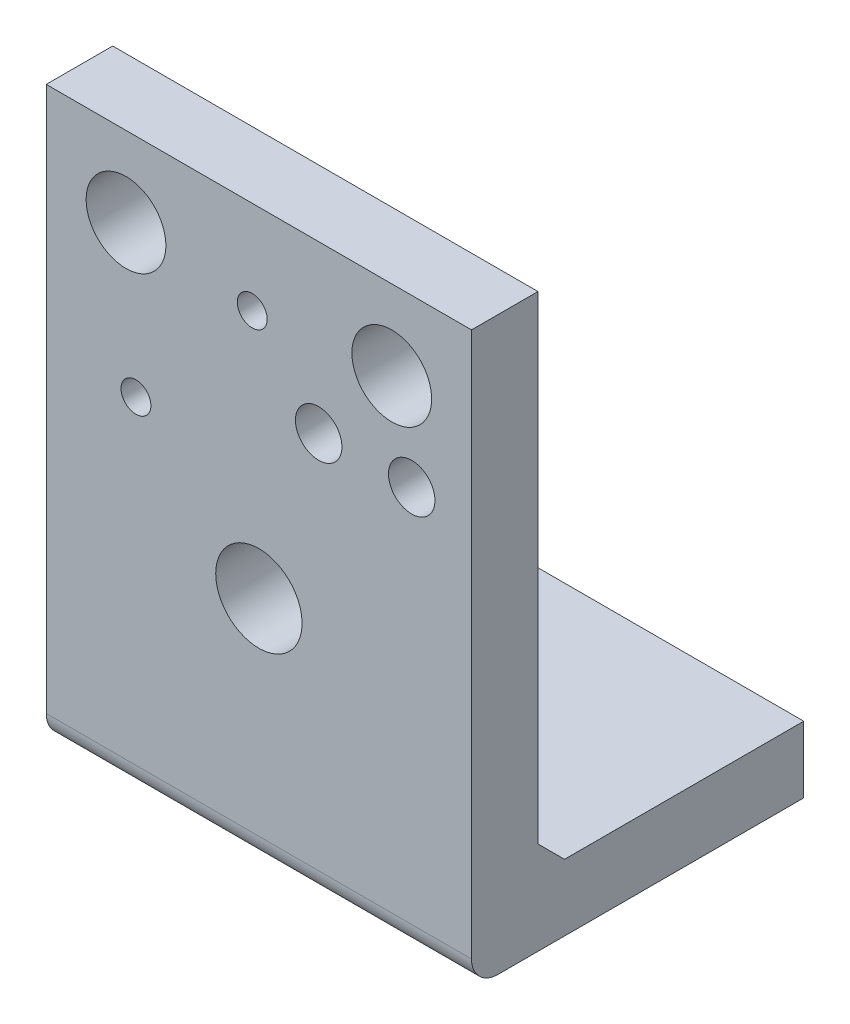
ISO-10303-21;
HEADER;
FILE_DESCRIPTION(('STEP AP214'),'2;1');
FILE_NAME('part.step','',(''),(''),'','','');
FILE_SCHEMA(('AUTOMOTIVE_DESIGN { 1 0 10303 214 1 1 1 1 }'));
ENDSEC;
DATA;
#1=APPLICATION_CONTEXT('core data for automotive mechanical design processes');
#2=APPLICATION_PROTOCOL_DEFINITION('international standard','automotive_design',2000,#1);
#3=PRODUCT_CONTEXT('',#1,'mechanical');
#4=PRODUCT('Part','Part','',(#3));
#5=PRODUCT_RELATED_PRODUCT_CATEGORY('part','',(#4));
#6=PRODUCT_DEFINITION_FORMATION('','',#4);
#7=PRODUCT_DEFINITION_CONTEXT('part definition',#1,'design');
#8=PRODUCT_DEFINITION('design','',#6,#7);
#9=PRODUCT_DEFINITION_SHAPE('','',#8);
#10=(LENGTH_UNIT() NAMED_UNIT(*) SI_UNIT(.MILLI.,.METRE.));
#11=(NAMED_UNIT(*) PLANE_ANGLE_UNIT() SI_UNIT($,.RADIAN.));
#12=(NAMED_UNIT(*) SI_UNIT($,.STERADIAN.) SOLID_ANGLE_UNIT());
#13=UNCERTAINTY_MEASURE_WITH_UNIT(LENGTH_MEASURE(1.E-05),#10,'distance_accuracy_value','');
#14=(GEOMETRIC_REPRESENTATION_CONTEXT(3) GLOBAL_UNCERTAINTY_ASSIGNED_CONTEXT((#13)) GLOBAL_UNIT_ASSIGNED_CONTEXT((#10,
#11,#12)) REPRESENTATION_CONTEXT('',''));
#15=CARTESIAN_POINT('',(0.,0.,0.));
#16=DIRECTION('',(0.,0.,1.));
#17=DIRECTION('',(1.,0.,0.));
#18=AXIS2_PLACEMENT_3D('',#15,#16,#17);
#19=CARTESIAN_POINT('',(0.,0.,0.));
#20=DIRECTION('',(0.,0.,1.));
#21=DIRECTION('',(1.,0.,0.));
#22=AXIS2_PLACEMENT_3D('',#19,#20,#21);
#23=PLANE('',#22);
#24=CARTESIAN_POINT('',(0.,-8.,0.));
#25=DIRECTION('',(0.,0.,-1.));
#26=DIRECTION('',(-1.,0.,0.));
#27=AXIS2_PLACEMENT_3D('',#24,#25,#26);
#28=CIRCLE('',#27,6.5);
#29=CARTESIAN_POINT('',(-6.50000000000001,-8.,0.));
#30=VERTEX_POINT('',#29);
#31=EDGE_CURVE('E509',#30,#30,#28,.T.);
#32=ORIENTED_EDGE('',*,*,#31,.F.);
#33=EDGE_LOOP('',(#32));
#34=FACE_BOUND('',#33,.T.);
#35=CARTESIAN_POINT('',(-18.5,8.99999999999999,0.));
#36=DIRECTION('',(0.,0.,-1.));
#37=DIRECTION('',(-1.,0.,0.));
#38=AXIS2_PLACEMENT_3D('',#35,#36,#37);
#39=CIRCLE('',#38,2.25);
#40=CARTESIAN_POINT('',(-20.75,8.99999999999999,0.));
#41=VERTEX_POINT('',#40);
#42=EDGE_CURVE('E549',#41,#41,#39,.T.);
#43=ORIENTED_EDGE('',*,*,#42,.F.);
#44=EDGE_LOOP('',(#43));
#45=FACE_BOUND('',#44,.T.);
#46=CARTESIAN_POINT('',(23.,18.,0.));
#47=DIRECTION('',(0.,0.,-1.));
#48=DIRECTION('',(-1.,0.,0.));
#49=AXIS2_PLACEMENT_3D('',#46,#47,#48);
#50=CIRCLE('',#49,3.5);
#51=CARTESIAN_POINT('',(19.5,18.,0.));
#52=VERTEX_POINT('',#51);
#53=EDGE_CURVE('E541',#52,#52,#50,.T.);
#54=ORIENTED_EDGE('',*,*,#53,.F.);
#55=EDGE_LOOP('',(#54));
#56=FACE_BOUND('',#55,.T.);
#57=CARTESIAN_POINT('',(8.99999999999999,18.,0.));
#58=DIRECTION('',(0.,0.,-1.));
#59=DIRECTION('',(-1.,0.,0.));
#60=AXIS2_PLACEMENT_3D('',#57,#58,#59);
#61=CIRCLE('',#60,3.5);
#62=CARTESIAN_POINT('',(5.49999999999999,18.,0.));
#63=VERTEX_POINT('',#62);
#64=EDGE_CURVE('E533',#63,#63,#61,.T.);
#65=ORIENTED_EDGE('',*,*,#64,.F.);
#66=EDGE_LOOP('',(#65));
#67=FACE_BOUND('',#66,.T.);
#68=CARTESIAN_POINT('',(20.,31.,0.));
#69=DIRECTION('',(0.,0.,-1.));
#70=DIRECTION('',(-1.,0.,0.));
#71=AXIS2_PLACEMENT_3D('',#68,#69,#70);
#72=CIRCLE('',#71,6.);
#73=CARTESIAN_POINT('',(14.,31.,0.));
#74=VERTEX_POINT('',#73);
#75=EDGE_CURVE('E525',#74,#74,#72,.T.);
#76=ORIENTED_EDGE('',*,*,#75,.F.);
#77=EDGE_LOOP('',(#76));
#78=FACE_BOUND('',#77,.T.);
#79=CARTESIAN_POINT('',(-1.00000000000001,29.,0.));
#80=DIRECTION('',(0.,0.,-1.));
#81=DIRECTION('',(-1.,0.,0.));
#82=AXIS2_PLACEMENT_3D('',#79,#80,#81);
#83=CIRCLE('',#82,2.25);
#84=CARTESIAN_POINT('',(-3.25000000000001,29.,0.));
#85=VERTEX_POINT('',#84);
#86=EDGE_CURVE('E517',#85,#85,#83,.T.);
#87=ORIENTED_EDGE('',*,*,#86,.F.);
#88=EDGE_LOOP('',(#87));
#89=FACE_BOUND('',#88,.T.);
#90=CARTESIAN_POINT('',(-20.,31.,0.));
#91=DIRECTION('',(0.,0.,-1.));
#92=DIRECTION('',(-1.,0.,0.));
#93=AXIS2_PLACEMENT_3D('',#90,#91,#92);
#94=CIRCLE('',#93,6.);
#95=CARTESIAN_POINT('',(-26.,31.,0.));
#96=VERTEX_POINT('',#95);
#97=EDGE_CURVE('E130',#96,#96,#94,.T.);
#98=ORIENTED_EDGE('',*,*,#97,.F.);
#99=EDGE_LOOP('',(#98));
#100=FACE_BOUND('',#99,.T.);
#101=DIRECTION('',(0.,1.,0.));
#102=VECTOR('',#101,1.);
#103=CARTESIAN_POINT('',(32.,43.,0.));
#104=LINE('',#103,#102);
#105=CARTESIAN_POINT('',(32.,-29.,0.));
#106=VERTEX_POINT('',#105);
#107=CARTESIAN_POINT('',(32.,43.,0.));
#108=VERTEX_POINT('',#107);
#109=EDGE_CURVE('E145',#106,#108,#104,.T.);
#110=ORIENTED_EDGE('',*,*,#109,.F.);
#111=DIRECTION('',(-1.,0.,0.));
#112=VECTOR('',#111,1.);
#113=CARTESIAN_POINT('',(-32.,-29.,0.));
#114=LINE('',#113,#112);
#115=CARTESIAN_POINT('',(-32.,-29.,0.));
#116=VERTEX_POINT('',#115);
#117=EDGE_CURVE('E178',#106,#116,#114,.T.);
#118=ORIENTED_EDGE('',*,*,#117,.T.);
#119=DIRECTION('',(0.,-1.,0.));
#120=VECTOR('',#119,1.);
#121=CARTESIAN_POINT('',(-32.,43.,0.));
#122=LINE('',#121,#120);
#123=CARTESIAN_POINT('',(-32.,43.,0.));
#124=VERTEX_POINT('',#123);
#125=EDGE_CURVE('E150',#124,#116,#122,.T.);
#126=ORIENTED_EDGE('',*,*,#125,.F.);
#127=DIRECTION('',(-1.,0.,0.));
#128=VECTOR('',#127,1.);
#129=CARTESIAN_POINT('',(-32.,43.,0.));
#130=LINE('',#129,#128);
#131=EDGE_CURVE('E158',#108,#124,#130,.T.);
#132=ORIENTED_EDGE('',*,*,#131,.F.);
#133=EDGE_LOOP('',(#110,#118,#126,#132));
#134=FACE_BOUND('',#133,.T.);
#135=ADVANCED_FACE('F41',(#34,#45,#56,#67,#78,#89,#100,#134),#23,.F.);
#136=CARTESIAN_POINT('',(32.,43.,10.));
#137=DIRECTION('',(-1.,0.,0.));
#138=DIRECTION('',(0.,-1.,0.));
#139=AXIS2_PLACEMENT_3D('',#136,#137,#138);
#140=PLANE('',#139);
#141=DIRECTION('',(0.,1.,0.));
#142=VECTOR('',#141,1.);
#143=CARTESIAN_POINT('',(32.,43.,10.));
#144=LINE('',#143,#142);
#145=CARTESIAN_POINT('',(32.,-39.,10.));
#146=VERTEX_POINT('',#145);
#147=CARTESIAN_POINT('',(32.,43.,10.));
#148=VERTEX_POINT('',#147);
#149=EDGE_CURVE('E146',#146,#148,#144,.T.);
#150=ORIENTED_EDGE('',*,*,#149,.F.);
#151=CARTESIAN_POINT('',(32.,-39.,6.));
#152=DIRECTION('',(-1.,0.,0.));
#153=DIRECTION('',(0.,-1.,0.));
#154=AXIS2_PLACEMENT_3D('',#151,#152,#153);
#155=CIRCLE('',#154,4.);
#156=CARTESIAN_POINT('',(32.,-43.,6.));
#157=VERTEX_POINT('',#156);
#158=EDGE_CURVE('E64',#146,#157,#155,.F.);
#159=ORIENTED_EDGE('',*,*,#158,.T.);
#160=DIRECTION('',(0.,0.,-1.));
#161=VECTOR('',#160,1.);
#162=CARTESIAN_POINT('',(32.,-43.,10.));
#163=LINE('',#162,#161);
#164=CARTESIAN_POINT('',(32.,-43.,-40.));
#165=VERTEX_POINT('',#164);
#166=EDGE_CURVE('E103',#157,#165,#163,.T.);
#167=ORIENTED_EDGE('',*,*,#166,.T.);
#168=DIRECTION('',(0.,-1.,0.));
#169=VECTOR('',#168,1.);
#170=CARTESIAN_POINT('',(32.,-43.,-40.));
#171=LINE('',#170,#169);
#172=CARTESIAN_POINT('',(32.,-33.,-40.));
#173=VERTEX_POINT('',#172);
#174=EDGE_CURVE('E108',#173,#165,#171,.T.);
#175=ORIENTED_EDGE('',*,*,#174,.F.);
#176=DIRECTION('',(0.,0.,1.));
#177=VECTOR('',#176,1.);
#178=CARTESIAN_POINT('',(32.,-33.,-40.));
#179=LINE('',#178,#177);
#180=CARTESIAN_POINT('',(32.,-33.,-4.00000000000003));
#181=VERTEX_POINT('',#180);
#182=EDGE_CURVE('E138',#173,#181,#179,.T.);
#183=ORIENTED_EDGE('',*,*,#182,.T.);
#184=DIRECTION('',(0.,-0.707106781186544,-0.707106781186551));
#185=VECTOR('',#184,1.);
#186=CARTESIAN_POINT('',(32.,11.9999999999996,41.));
#187=LINE('',#186,#185);
#188=EDGE_CURVE('E181',#181,#106,#187,.F.);
#189=ORIENTED_EDGE('',*,*,#188,.T.);
#190=ORIENTED_EDGE('',*,*,#109,.T.);
#191=DIRECTION('',(0.,0.,-1.));
#192=VECTOR('',#191,1.);
#193=CARTESIAN_POINT('',(32.,43.,10.));
#194=LINE('',#193,#192);
#195=EDGE_CURVE('E170',#148,#108,#194,.T.);
#196=ORIENTED_EDGE('',*,*,#195,.F.);
#197=EDGE_LOOP('',(#150,#159,#167,#175,#183,#189,#190,#196));
#198=FACE_BOUND('',#197,.T.);
#199=ADVANCED_FACE('F105',(#198),#140,.F.);
#200=CARTESIAN_POINT('',(-32.,43.,10.));
#201=DIRECTION('',(0.,-1.,0.));
#202=DIRECTION('',(0.,0.,-1.));
#203=AXIS2_PLACEMENT_3D('',#200,#201,#202);
#204=PLANE('',#203);
#205=ORIENTED_EDGE('',*,*,#131,.T.);
#206=DIRECTION('',(0.,0.,-1.));
#207=VECTOR('',#206,1.);
#208=CARTESIAN_POINT('',(-32.,43.,10.));
#209=LINE('',#208,#207);
#210=CARTESIAN_POINT('',(-32.,43.,10.));
#211=VERTEX_POINT('',#210);
#212=EDGE_CURVE('E166',#211,#124,#209,.T.);
#213=ORIENTED_EDGE('',*,*,#212,.F.);
#214=DIRECTION('',(-1.,0.,0.));
#215=VECTOR('',#214,1.);
#216=CARTESIAN_POINT('',(-32.,43.,10.));
#217=LINE('',#216,#215);
#218=EDGE_CURVE('E149',#148,#211,#217,.T.);
#219=ORIENTED_EDGE('',*,*,#218,.F.);
#220=ORIENTED_EDGE('',*,*,#195,.T.);
#221=EDGE_LOOP('',(#205,#213,#219,#220));
#222=FACE_BOUND('',#221,.T.);
#223=ADVANCED_FACE('F204',(#222),#204,.F.);
#224=CARTESIAN_POINT('',(-32.,43.,10.));
#225=DIRECTION('',(1.,0.,0.));
#226=DIRECTION('',(0.,1.,0.));
#227=AXIS2_PLACEMENT_3D('',#224,#225,#226);
#228=PLANE('',#227);
#229=DIRECTION('',(0.,0.,-1.));
#230=VECTOR('',#229,1.);
#231=CARTESIAN_POINT('',(-32.,-43.,10.));
#232=LINE('',#231,#230);
#233=CARTESIAN_POINT('',(-32.,-43.,6.));
#234=VERTEX_POINT('',#233);
#235=CARTESIAN_POINT('',(-32.,-43.,-40.));
#236=VERTEX_POINT('',#235);
#237=EDGE_CURVE('E110',#234,#236,#232,.T.);
#238=ORIENTED_EDGE('',*,*,#237,.F.);
#239=CARTESIAN_POINT('',(-32.,-39.,6.));
#240=DIRECTION('',(1.,0.,0.));
#241=DIRECTION('',(0.,1.,0.));
#242=AXIS2_PLACEMENT_3D('',#239,#240,#241);
#243=CIRCLE('',#242,4.);
#244=CARTESIAN_POINT('',(-32.,-39.,10.));
#245=VERTEX_POINT('',#244);
#246=EDGE_CURVE('E11',#234,#245,#243,.F.);
#247=ORIENTED_EDGE('',*,*,#246,.T.);
#248=DIRECTION('',(0.,-1.,0.));
#249=VECTOR('',#248,1.);
#250=CARTESIAN_POINT('',(-32.,43.,10.));
#251=LINE('',#250,#249);
#252=EDGE_CURVE('E111',#211,#245,#251,.T.);
#253=ORIENTED_EDGE('',*,*,#252,.F.);
#254=ORIENTED_EDGE('',*,*,#212,.T.);
#255=ORIENTED_EDGE('',*,*,#125,.T.);
#256=DIRECTION('',(0.,0.707106781186544,0.707106781186551));
#257=VECTOR('',#256,1.);
#258=CARTESIAN_POINT('',(-32.,11.9999999999996,41.));
#259=LINE('',#258,#257);
#260=CARTESIAN_POINT('',(-32.,-33.,-4.00000000000003));
#261=VERTEX_POINT('',#260);
#262=EDGE_CURVE('E184',#116,#261,#259,.F.);
#263=ORIENTED_EDGE('',*,*,#262,.T.);
#264=DIRECTION('',(0.,0.,1.));
#265=VECTOR('',#264,1.);
#266=CARTESIAN_POINT('',(-32.,-33.,-40.));
#267=LINE('',#266,#265);
#268=CARTESIAN_POINT('',(-32.,-33.,-40.));
#269=VERTEX_POINT('',#268);
#270=EDGE_CURVE('E141',#269,#261,#267,.T.);
#271=ORIENTED_EDGE('',*,*,#270,.F.);
#272=DIRECTION('',(0.,1.,0.));
#273=VECTOR('',#272,1.);
#274=CARTESIAN_POINT('',(-32.,-43.,-40.));
#275=LINE('',#274,#273);
#276=EDGE_CURVE('E119',#236,#269,#275,.T.);
#277=ORIENTED_EDGE('',*,*,#276,.F.);
#278=EDGE_LOOP('',(#238,#247,#253,#254,#255,#263,#271,#277));
#279=FACE_BOUND('',#278,.T.);
#280=ADVANCED_FACE('F208',(#279),#228,.F.);
#281=CARTESIAN_POINT('',(-32.,-43.,10.));
#282=DIRECTION('',(0.,1.,0.));
#283=DIRECTION('',(0.,0.,1.));
#284=AXIS2_PLACEMENT_3D('',#281,#282,#283);
#285=PLANE('',#284);
#286=CARTESIAN_POINT('',(-5.25,-43.,-11.25));
#287=DIRECTION('',(0.,1.,0.));
#288=DIRECTION('',(0.,0.,1.));
#289=AXIS2_PLACEMENT_3D('',#286,#287,#288);
#290=CIRCLE('',#289,1.25);
#291=CARTESIAN_POINT('',(-5.25,-43.,-10.));
#292=VERTEX_POINT('',#291);
#293=EDGE_CURVE('E471',#292,#292,#290,.T.);
#294=ORIENTED_EDGE('',*,*,#293,.T.);
#295=EDGE_LOOP('',(#294));
#296=FACE_BOUND('',#295,.T.);
#297=CARTESIAN_POINT('',(5.25,-43.,-11.25));
#298=DIRECTION('',(0.,1.,0.));
#299=DIRECTION('',(0.,0.,1.));
#300=AXIS2_PLACEMENT_3D('',#297,#298,#299);
#301=CIRCLE('',#300,1.25);
#302=CARTESIAN_POINT('',(5.25,-43.,-10.));
#303=VERTEX_POINT('',#302);
#304=EDGE_CURVE('E504',#303,#303,#301,.T.);
#305=ORIENTED_EDGE('',*,*,#304,.T.);
#306=EDGE_LOOP('',(#305));
#307=FACE_BOUND('',#306,.T.);
#308=CARTESIAN_POINT('',(0.,-43.,-6.95405845398161));
#309=DIRECTION('',(0.,1.,0.));
#310=DIRECTION('',(0.,0.,1.));
#311=AXIS2_PLACEMENT_3D('',#308,#309,#310);
#312=CIRCLE('',#311,2.);
#313=CARTESIAN_POINT('',(0.,-43.,-4.95405845398161));
#314=VERTEX_POINT('',#313);
#315=EDGE_CURVE('E496',#314,#314,#312,.T.);
#316=ORIENTED_EDGE('',*,*,#315,.T.);
#317=EDGE_LOOP('',(#316));
#318=FACE_BOUND('',#317,.T.);
#319=CARTESIAN_POINT('',(5.25,-43.,-21.75));
#320=DIRECTION('',(0.,1.,0.));
#321=DIRECTION('',(0.,0.,1.));
#322=AXIS2_PLACEMENT_3D('',#319,#320,#321);
#323=CIRCLE('',#322,1.25);
#324=CARTESIAN_POINT('',(5.25,-43.,-20.5));
#325=VERTEX_POINT('',#324);
#326=EDGE_CURVE('E487',#325,#325,#323,.T.);
#327=ORIENTED_EDGE('',*,*,#326,.T.);
#328=EDGE_LOOP('',(#327));
#329=FACE_BOUND('',#328,.T.);
#330=CARTESIAN_POINT('',(-9.54594154601839,-43.,-16.5));
#331=DIRECTION('',(0.,1.,0.));
#332=DIRECTION('',(0.,0.,1.));
#333=AXIS2_PLACEMENT_3D('',#330,#331,#332);
#334=CIRCLE('',#333,2.);
#335=CARTESIAN_POINT('',(-9.54594154601839,-43.,-14.5));
#336=VERTEX_POINT('',#335);
#337=EDGE_CURVE('E584',#336,#336,#334,.T.);
#338=ORIENTED_EDGE('',*,*,#337,.T.);
#339=EDGE_LOOP('',(#338));
#340=FACE_BOUND('',#339,.T.);
#341=CARTESIAN_POINT('',(0.,-43.,-26.0459415460184));
#342=DIRECTION('',(0.,1.,0.));
#343=DIRECTION('',(0.,0.,1.));
#344=AXIS2_PLACEMENT_3D('',#341,#342,#343);
#345=CIRCLE('',#344,2.);
#346=CARTESIAN_POINT('',(0.,-43.,-24.0459415460184));
#347=VERTEX_POINT('',#346);
#348=EDGE_CURVE('E573',#347,#347,#345,.T.);
#349=ORIENTED_EDGE('',*,*,#348,.T.);
#350=EDGE_LOOP('',(#349));
#351=FACE_BOUND('',#350,.T.);
#352=CARTESIAN_POINT('',(9.54594154601839,-43.,-16.5));
#353=DIRECTION('',(0.,1.,0.));
#354=DIRECTION('',(0.,0.,1.));
#355=AXIS2_PLACEMENT_3D('',#352,#353,#354);
#356=CIRCLE('',#355,2.);
#357=CARTESIAN_POINT('',(9.54594154601839,-43.,-14.5));
#358=VERTEX_POINT('',#357);
#359=EDGE_CURVE('E572',#358,#358,#356,.T.);
#360=ORIENTED_EDGE('',*,*,#359,.T.);
#361=EDGE_LOOP('',(#360));
#362=FACE_BOUND('',#361,.T.);
#363=CARTESIAN_POINT('',(-5.25,-43.,-21.75));
#364=DIRECTION('',(0.,1.,0.));
#365=DIRECTION('',(0.,0.,1.));
#366=AXIS2_PLACEMENT_3D('',#363,#364,#365);
#367=CIRCLE('',#366,1.25);
#368=CARTESIAN_POINT('',(-5.25,-43.,-20.5));
#369=VERTEX_POINT('',#368);
#370=EDGE_CURVE('E476',#369,#369,#367,.T.);
#371=ORIENTED_EDGE('',*,*,#370,.T.);
#372=EDGE_LOOP('',(#371));
#373=FACE_BOUND('',#372,.T.);
#374=CARTESIAN_POINT('',(0.,-43.,-16.5));
#375=DIRECTION('',(0.,1.,0.));
#376=DIRECTION('',(0.,0.,1.));
#377=AXIS2_PLACEMENT_3D('',#374,#375,#376);
#378=CIRCLE('',#377,2.);
#379=CARTESIAN_POINT('',(0.,-43.,-14.5));
#380=VERTEX_POINT('',#379);
#381=EDGE_CURVE('E505',#380,#380,#378,.T.);
#382=ORIENTED_EDGE('',*,*,#381,.T.);
#383=EDGE_LOOP('',(#382));
#384=FACE_BOUND('',#383,.T.);
#385=ORIENTED_EDGE('',*,*,#166,.F.);
#386=DIRECTION('',(1.,0.,0.));
#387=VECTOR('',#386,1.);
#388=CARTESIAN_POINT('',(-32.,-43.,6.));
#389=LINE('',#388,#387);
#390=EDGE_CURVE('E50',#157,#234,#389,.F.);
#391=ORIENTED_EDGE('',*,*,#390,.T.);
#392=ORIENTED_EDGE('',*,*,#237,.T.);
#393=DIRECTION('',(-1.,0.,0.));
#394=VECTOR('',#393,1.);
#395=CARTESIAN_POINT('',(32.,-43.,-40.));
#396=LINE('',#395,#394);
#397=EDGE_CURVE('E114',#165,#236,#396,.T.);
#398=ORIENTED_EDGE('',*,*,#397,.F.);
#399=EDGE_LOOP('',(#385,#391,#392,#398));
#400=FACE_BOUND('',#399,.T.);
#401=ADVANCED_FACE('F115',(#296,#307,#318,#329,#340,#351,#362,#373,#384,#400),#285,.F.);
#402=CARTESIAN_POINT('',(0.,0.,10.));
#403=DIRECTION('',(0.,0.,1.));
#404=DIRECTION('',(1.,0.,0.));
#405=AXIS2_PLACEMENT_3D('',#402,#403,#404);
#406=PLANE('',#405);
#407=CARTESIAN_POINT('',(0.,-8.,10.));
#408=DIRECTION('',(0.,0.,-1.));
#409=DIRECTION('',(-1.,0.,0.));
#410=AXIS2_PLACEMENT_3D('',#407,#408,#409);
#411=CIRCLE('',#410,6.5);
#412=CARTESIAN_POINT('',(-6.50000000000001,-8.,10.));
#413=VERTEX_POINT('',#412);
#414=EDGE_CURVE('E553',#413,#413,#411,.T.);
#415=ORIENTED_EDGE('',*,*,#414,.T.);
#416=EDGE_LOOP('',(#415));
#417=FACE_BOUND('',#416,.T.);
#418=CARTESIAN_POINT('',(-18.5,8.99999999999999,10.));
#419=DIRECTION('',(0.,0.,-1.));
#420=DIRECTION('',(-1.,0.,0.));
#421=AXIS2_PLACEMENT_3D('',#418,#419,#420);
#422=CIRCLE('',#421,2.25);
#423=CARTESIAN_POINT('',(-20.75,8.99999999999999,10.));
#424=VERTEX_POINT('',#423);
#425=EDGE_CURVE('E545',#424,#424,#422,.T.);
#426=ORIENTED_EDGE('',*,*,#425,.T.);
#427=EDGE_LOOP('',(#426));
#428=FACE_BOUND('',#427,.T.);
#429=CARTESIAN_POINT('',(23.,18.,10.));
#430=DIRECTION('',(0.,0.,-1.));
#431=DIRECTION('',(-1.,0.,0.));
#432=AXIS2_PLACEMENT_3D('',#429,#430,#431);
#433=CIRCLE('',#432,3.5);
#434=CARTESIAN_POINT('',(19.5,18.,10.));
#435=VERTEX_POINT('',#434);
#436=EDGE_CURVE('E537',#435,#435,#433,.T.);
#437=ORIENTED_EDGE('',*,*,#436,.T.);
#438=EDGE_LOOP('',(#437));
#439=FACE_BOUND('',#438,.T.);
#440=CARTESIAN_POINT('',(8.99999999999999,18.,10.));
#441=DIRECTION('',(0.,0.,-1.));
#442=DIRECTION('',(-1.,0.,0.));
#443=AXIS2_PLACEMENT_3D('',#440,#441,#442);
#444=CIRCLE('',#443,3.5);
#445=CARTESIAN_POINT('',(5.49999999999999,18.,10.));
#446=VERTEX_POINT('',#445);
#447=EDGE_CURVE('E529',#446,#446,#444,.T.);
#448=ORIENTED_EDGE('',*,*,#447,.T.);
#449=EDGE_LOOP('',(#448));
#450=FACE_BOUND('',#449,.T.);
#451=CARTESIAN_POINT('',(20.,31.,10.));
#452=DIRECTION('',(0.,0.,-1.));
#453=DIRECTION('',(-1.,0.,0.));
#454=AXIS2_PLACEMENT_3D('',#451,#452,#453);
#455=CIRCLE('',#454,6.);
#456=CARTESIAN_POINT('',(14.,31.,10.));
#457=VERTEX_POINT('',#456);
#458=EDGE_CURVE('E521',#457,#457,#455,.T.);
#459=ORIENTED_EDGE('',*,*,#458,.T.);
#460=EDGE_LOOP('',(#459));
#461=FACE_BOUND('',#460,.T.);
#462=CARTESIAN_POINT('',(-1.00000000000001,29.,10.));
#463=DIRECTION('',(0.,0.,-1.));
#464=DIRECTION('',(-1.,0.,0.));
#465=AXIS2_PLACEMENT_3D('',#462,#463,#464);
#466=CIRCLE('',#465,2.25);
#467=CARTESIAN_POINT('',(-3.25000000000001,29.,10.));
#468=VERTEX_POINT('',#467);
#469=EDGE_CURVE('E513',#468,#468,#466,.T.);
#470=ORIENTED_EDGE('',*,*,#469,.T.);
#471=EDGE_LOOP('',(#470));
#472=FACE_BOUND('',#471,.T.);
#473=CARTESIAN_POINT('',(-20.,31.,10.));
#474=DIRECTION('',(0.,0.,-1.));
#475=DIRECTION('',(-1.,0.,0.));
#476=AXIS2_PLACEMENT_3D('',#473,#474,#475);
#477=CIRCLE('',#476,6.);
#478=CARTESIAN_POINT('',(-26.,31.,10.));
#479=VERTEX_POINT('',#478);
#480=EDGE_CURVE('E126',#479,#479,#477,.T.);
#481=ORIENTED_EDGE('',*,*,#480,.T.);
#482=EDGE_LOOP('',(#481));
#483=FACE_BOUND('',#482,.T.);
#484=ORIENTED_EDGE('',*,*,#252,.T.);
#485=DIRECTION('',(1.,0.,0.));
#486=VECTOR('',#485,1.);
#487=CARTESIAN_POINT('',(32.,-39.,10.));
#488=LINE('',#487,#486);
#489=EDGE_CURVE('E187',#245,#146,#488,.T.);
#490=ORIENTED_EDGE('',*,*,#489,.T.);
#491=ORIENTED_EDGE('',*,*,#149,.T.);
#492=ORIENTED_EDGE('',*,*,#218,.T.);
#493=EDGE_LOOP('',(#484,#490,#491,#492));
#494=FACE_BOUND('',#493,.T.);
#495=ADVANCED_FACE('F195',(#417,#428,#439,#450,#461,#472,#483,#494),#406,.T.);
#496=CARTESIAN_POINT('',(32.,-33.,-40.));
#497=DIRECTION('',(0.,-1.,0.));
#498=DIRECTION('',(0.,0.,-1.));
#499=AXIS2_PLACEMENT_3D('',#496,#497,#498);
#500=PLANE('',#499);
#501=CARTESIAN_POINT('',(-5.25,-33.,-11.25));
#502=DIRECTION('',(0.,1.,0.));
#503=DIRECTION('',(0.,0.,1.));
#504=AXIS2_PLACEMENT_3D('',#501,#502,#503);
#505=CIRCLE('',#504,1.25);
#506=CARTESIAN_POINT('',(-5.25,-33.,-10.));
#507=VERTEX_POINT('',#506);
#508=EDGE_CURVE('E474',#507,#507,#505,.T.);
#509=ORIENTED_EDGE('',*,*,#508,.F.);
#510=EDGE_LOOP('',(#509));
#511=FACE_BOUND('',#510,.T.);
#512=CARTESIAN_POINT('',(5.25,-33.,-11.25));
#513=DIRECTION('',(0.,1.,0.));
#514=DIRECTION('',(0.,0.,1.));
#515=AXIS2_PLACEMENT_3D('',#512,#513,#514);
#516=CIRCLE('',#515,1.25);
#517=CARTESIAN_POINT('',(5.25,-33.,-10.));
#518=VERTEX_POINT('',#517);
#519=EDGE_CURVE('E480',#518,#518,#516,.T.);
#520=ORIENTED_EDGE('',*,*,#519,.F.);
#521=EDGE_LOOP('',(#520));
#522=FACE_BOUND('',#521,.T.);
#523=CARTESIAN_POINT('',(0.,-33.,-6.95405845398161));
#524=DIRECTION('',(0.,1.,0.));
#525=DIRECTION('',(0.,0.,1.));
#526=AXIS2_PLACEMENT_3D('',#523,#524,#525);
#527=CIRCLE('',#526,2.);
#528=CARTESIAN_POINT('',(0.,-33.,-4.95405845398161));
#529=VERTEX_POINT('',#528);
#530=EDGE_CURVE('E500',#529,#529,#527,.T.);
#531=ORIENTED_EDGE('',*,*,#530,.F.);
#532=EDGE_LOOP('',(#531));
#533=FACE_BOUND('',#532,.T.);
#534=CARTESIAN_POINT('',(5.25,-33.,-21.75));
#535=DIRECTION('',(0.,1.,0.));
#536=DIRECTION('',(0.,0.,1.));
#537=AXIS2_PLACEMENT_3D('',#534,#535,#536);
#538=CIRCLE('',#537,1.25);
#539=CARTESIAN_POINT('',(5.25,-33.,-20.5));
#540=VERTEX_POINT('',#539);
#541=EDGE_CURVE('E492',#540,#540,#538,.T.);
#542=ORIENTED_EDGE('',*,*,#541,.F.);
#543=EDGE_LOOP('',(#542));
#544=FACE_BOUND('',#543,.T.);
#545=CARTESIAN_POINT('',(-9.54594154601839,-33.,-16.5));
#546=DIRECTION('',(0.,1.,0.));
#547=DIRECTION('',(0.,0.,1.));
#548=AXIS2_PLACEMENT_3D('',#545,#546,#547);
#549=CIRCLE('',#548,2.);
#550=CARTESIAN_POINT('',(-9.54594154601839,-33.,-14.5));
#551=VERTEX_POINT('',#550);
#552=EDGE_CURVE('E580',#551,#551,#549,.T.);
#553=ORIENTED_EDGE('',*,*,#552,.F.);
#554=EDGE_LOOP('',(#553));
#555=FACE_BOUND('',#554,.T.);
#556=CARTESIAN_POINT('',(0.,-33.,-26.0459415460184));
#557=DIRECTION('',(0.,1.,0.));
#558=DIRECTION('',(0.,0.,1.));
#559=AXIS2_PLACEMENT_3D('',#556,#557,#558);
#560=CIRCLE('',#559,2.);
#561=CARTESIAN_POINT('',(0.,-33.,-24.0459415460184));
#562=VERTEX_POINT('',#561);
#563=EDGE_CURVE('E588',#562,#562,#560,.T.);
#564=ORIENTED_EDGE('',*,*,#563,.F.);
#565=EDGE_LOOP('',(#564));
#566=FACE_BOUND('',#565,.T.);
#567=CARTESIAN_POINT('',(9.54594154601839,-33.,-16.5));
#568=DIRECTION('',(0.,1.,0.));
#569=DIRECTION('',(0.,0.,1.));
#570=AXIS2_PLACEMENT_3D('',#567,#568,#569);
#571=CIRCLE('',#570,2.);
#572=CARTESIAN_POINT('',(9.54594154601839,-33.,-14.5));
#573=VERTEX_POINT('',#572);
#574=EDGE_CURVE('E568',#573,#573,#571,.T.);
#575=ORIENTED_EDGE('',*,*,#574,.F.);
#576=EDGE_LOOP('',(#575));
#577=FACE_BOUND('',#576,.T.);
#578=CARTESIAN_POINT('',(-5.25,-33.,-21.75));
#579=DIRECTION('',(0.,1.,0.));
#580=DIRECTION('',(0.,0.,1.));
#581=AXIS2_PLACEMENT_3D('',#578,#579,#580);
#582=CIRCLE('',#581,1.25);
#583=CARTESIAN_POINT('',(-5.25,-33.,-20.5));
#584=VERTEX_POINT('',#583);
#585=EDGE_CURVE('E483',#584,#584,#582,.T.);
#586=ORIENTED_EDGE('',*,*,#585,.F.);
#587=EDGE_LOOP('',(#586));
#588=FACE_BOUND('',#587,.T.);
#589=CARTESIAN_POINT('',(0.,-33.,-16.5));
#590=DIRECTION('',(0.,1.,0.));
#591=DIRECTION('',(0.,0.,1.));
#592=AXIS2_PLACEMENT_3D('',#589,#590,#591);
#593=CIRCLE('',#592,2.);
#594=CARTESIAN_POINT('',(0.,-33.,-14.5));
#595=VERTEX_POINT('',#594);
#596=EDGE_CURVE('E491',#595,#595,#593,.T.);
#597=ORIENTED_EDGE('',*,*,#596,.F.);
#598=EDGE_LOOP('',(#597));
#599=FACE_BOUND('',#598,.T.);
#600=ORIENTED_EDGE('',*,*,#270,.T.);
#601=DIRECTION('',(1.,0.,0.));
#602=VECTOR('',#601,1.);
#603=CARTESIAN_POINT('',(32.,-33.,-4.00000000000003));
#604=LINE('',#603,#602);
#605=EDGE_CURVE('E174',#261,#181,#604,.T.);
#606=ORIENTED_EDGE('',*,*,#605,.T.);
#607=ORIENTED_EDGE('',*,*,#182,.F.);
#608=DIRECTION('',(1.,0.,0.));
#609=VECTOR('',#608,1.);
#610=CARTESIAN_POINT('',(32.,-33.,-40.));
#611=LINE('',#610,#609);
#612=EDGE_CURVE('E123',#269,#173,#611,.T.);
#613=ORIENTED_EDGE('',*,*,#612,.F.);
#614=EDGE_LOOP('',(#600,#606,#607,#613));
#615=FACE_BOUND('',#614,.T.);
#616=ADVANCED_FACE('F256',(#511,#522,#533,#544,#555,#566,#577,#588,#599,#615),#500,.F.);
#617=CARTESIAN_POINT('',(0.,0.,-40.));
#618=DIRECTION('',(0.,0.,1.));
#619=DIRECTION('',(1.,0.,0.));
#620=AXIS2_PLACEMENT_3D('',#617,#618,#619);
#621=PLANE('',#620);
#622=ORIENTED_EDGE('',*,*,#174,.T.);
#623=ORIENTED_EDGE('',*,*,#397,.T.);
#624=ORIENTED_EDGE('',*,*,#276,.T.);
#625=ORIENTED_EDGE('',*,*,#612,.T.);
#626=EDGE_LOOP('',(#622,#623,#624,#625));
#627=FACE_BOUND('',#626,.T.);
#628=ADVANCED_FACE('F121',(#627),#621,.F.);
#629=CARTESIAN_POINT('',(-20.,31.,10.));
#630=DIRECTION('',(0.,0.,-1.));
#631=DIRECTION('',(-1.,0.,0.));
#632=AXIS2_PLACEMENT_3D('',#629,#630,#631);
#633=CYLINDRICAL_SURFACE('',#632,6.);
#634=ORIENTED_EDGE('',*,*,#480,.F.);
#635=EDGE_LOOP('',(#634));
#636=FACE_BOUND('',#635,.T.);
#637=ORIENTED_EDGE('',*,*,#97,.T.);
#638=EDGE_LOOP('',(#637));
#639=FACE_BOUND('',#638,.T.);
#640=ADVANCED_FACE('F269',(#636,#639),#633,.F.);
#641=CARTESIAN_POINT('',(-1.00000000000001,29.,10.));
#642=DIRECTION('',(0.,0.,-1.));
#643=DIRECTION('',(-1.,0.,0.));
#644=AXIS2_PLACEMENT_3D('',#641,#642,#643);
#645=CYLINDRICAL_SURFACE('',#644,2.25);
#646=ORIENTED_EDGE('',*,*,#469,.F.);
#647=EDGE_LOOP('',(#646));
#648=FACE_BOUND('',#647,.T.);
#649=ORIENTED_EDGE('',*,*,#86,.T.);
#650=EDGE_LOOP('',(#649));
#651=FACE_BOUND('',#650,.T.);
#652=ADVANCED_FACE('F276',(#648,#651),#645,.F.);
#653=CARTESIAN_POINT('',(20.,31.,10.));
#654=DIRECTION('',(0.,0.,-1.));
#655=DIRECTION('',(-1.,0.,0.));
#656=AXIS2_PLACEMENT_3D('',#653,#654,#655);
#657=CYLINDRICAL_SURFACE('',#656,6.);
#658=ORIENTED_EDGE('',*,*,#458,.F.);
#659=EDGE_LOOP('',(#658));
#660=FACE_BOUND('',#659,.T.);
#661=ORIENTED_EDGE('',*,*,#75,.T.);
#662=EDGE_LOOP('',(#661));
#663=FACE_BOUND('',#662,.T.);
#664=ADVANCED_FACE('F284',(#660,#663),#657,.F.);
#665=CARTESIAN_POINT('',(8.99999999999999,18.,10.));
#666=DIRECTION('',(0.,0.,-1.));
#667=DIRECTION('',(-1.,0.,0.));
#668=AXIS2_PLACEMENT_3D('',#665,#666,#667);
#669=CYLINDRICAL_SURFACE('',#668,3.5);
#670=ORIENTED_EDGE('',*,*,#447,.F.);
#671=EDGE_LOOP('',(#670));
#672=FACE_BOUND('',#671,.T.);
#673=ORIENTED_EDGE('',*,*,#64,.T.);
#674=EDGE_LOOP('',(#673));
#675=FACE_BOUND('',#674,.T.);
#676=ADVANCED_FACE('F292',(#672,#675),#669,.F.);
#677=CARTESIAN_POINT('',(23.,18.,10.));
#678=DIRECTION('',(0.,0.,-1.));
#679=DIRECTION('',(-1.,0.,0.));
#680=AXIS2_PLACEMENT_3D('',#677,#678,#679);
#681=CYLINDRICAL_SURFACE('',#680,3.5);
#682=ORIENTED_EDGE('',*,*,#436,.F.);
#683=EDGE_LOOP('',(#682));
#684=FACE_BOUND('',#683,.T.);
#685=ORIENTED_EDGE('',*,*,#53,.T.);
#686=EDGE_LOOP('',(#685));
#687=FACE_BOUND('',#686,.T.);
#688=ADVANCED_FACE('F300',(#684,#687),#681,.F.);
#689=CARTESIAN_POINT('',(-18.5,8.99999999999999,10.));
#690=DIRECTION('',(0.,0.,-1.));
#691=DIRECTION('',(-1.,0.,0.));
#692=AXIS2_PLACEMENT_3D('',#689,#690,#691);
#693=CYLINDRICAL_SURFACE('',#692,2.25);
#694=ORIENTED_EDGE('',*,*,#425,.F.);
#695=EDGE_LOOP('',(#694));
#696=FACE_BOUND('',#695,.T.);
#697=ORIENTED_EDGE('',*,*,#42,.T.);
#698=EDGE_LOOP('',(#697));
#699=FACE_BOUND('',#698,.T.);
#700=ADVANCED_FACE('F308',(#696,#699),#693,.F.);
#701=CARTESIAN_POINT('',(0.,-8.,10.));
#702=DIRECTION('',(0.,0.,-1.));
#703=DIRECTION('',(-1.,0.,0.));
#704=AXIS2_PLACEMENT_3D('',#701,#702,#703);
#705=CYLINDRICAL_SURFACE('',#704,6.5);
#706=ORIENTED_EDGE('',*,*,#414,.F.);
#707=EDGE_LOOP('',(#706));
#708=FACE_BOUND('',#707,.T.);
#709=ORIENTED_EDGE('',*,*,#31,.T.);
#710=EDGE_LOOP('',(#709));
#711=FACE_BOUND('',#710,.T.);
#712=ADVANCED_FACE('F316',(#708,#711),#705,.F.);
#713=CARTESIAN_POINT('',(0.,-43.,-16.5));
#714=DIRECTION('',(0.,1.,0.));
#715=DIRECTION('',(0.,0.,1.));
#716=AXIS2_PLACEMENT_3D('',#713,#714,#715);
#717=CYLINDRICAL_SURFACE('',#716,2.);
#718=ORIENTED_EDGE('',*,*,#381,.F.);
#719=EDGE_LOOP('',(#718));
#720=FACE_BOUND('',#719,.T.);
#721=ORIENTED_EDGE('',*,*,#596,.T.);
#722=EDGE_LOOP('',(#721));
#723=FACE_BOUND('',#722,.T.);
#724=ADVANCED_FACE('F324',(#720,#723),#717,.F.);
#725=CARTESIAN_POINT('',(-5.25,-43.,-21.75));
#726=DIRECTION('',(0.,1.,0.));
#727=DIRECTION('',(0.,0.,1.));
#728=AXIS2_PLACEMENT_3D('',#725,#726,#727);
#729=CYLINDRICAL_SURFACE('',#728,1.25);
#730=ORIENTED_EDGE('',*,*,#370,.F.);
#731=EDGE_LOOP('',(#730));
#732=FACE_BOUND('',#731,.T.);
#733=ORIENTED_EDGE('',*,*,#585,.T.);
#734=EDGE_LOOP('',(#733));
#735=FACE_BOUND('',#734,.T.);
#736=ADVANCED_FACE('F332',(#732,#735),#729,.F.);
#737=CARTESIAN_POINT('',(9.54594154601839,-43.,-16.5));
#738=DIRECTION('',(0.,1.,0.));
#739=DIRECTION('',(0.,0.,1.));
#740=AXIS2_PLACEMENT_3D('',#737,#738,#739);
#741=CYLINDRICAL_SURFACE('',#740,2.);
#742=ORIENTED_EDGE('',*,*,#359,.F.);
#743=EDGE_LOOP('',(#742));
#744=FACE_BOUND('',#743,.T.);
#745=ORIENTED_EDGE('',*,*,#574,.T.);
#746=EDGE_LOOP('',(#745));
#747=FACE_BOUND('',#746,.T.);
#748=ADVANCED_FACE('F340',(#744,#747),#741,.F.);
#749=CARTESIAN_POINT('',(0.,-43.,-26.0459415460184));
#750=DIRECTION('',(0.,1.,0.));
#751=DIRECTION('',(0.,0.,1.));
#752=AXIS2_PLACEMENT_3D('',#749,#750,#751);
#753=CYLINDRICAL_SURFACE('',#752,2.);
#754=ORIENTED_EDGE('',*,*,#348,.F.);
#755=EDGE_LOOP('',(#754));
#756=FACE_BOUND('',#755,.T.);
#757=ORIENTED_EDGE('',*,*,#563,.T.);
#758=EDGE_LOOP('',(#757));
#759=FACE_BOUND('',#758,.T.);
#760=ADVANCED_FACE('F348',(#756,#759),#753,.F.);
#761=CARTESIAN_POINT('',(-9.54594154601839,-43.,-16.5));
#762=DIRECTION('',(0.,1.,0.));
#763=DIRECTION('',(0.,0.,1.));
#764=AXIS2_PLACEMENT_3D('',#761,#762,#763);
#765=CYLINDRICAL_SURFACE('',#764,2.);
#766=ORIENTED_EDGE('',*,*,#337,.F.);
#767=EDGE_LOOP('',(#766));
#768=FACE_BOUND('',#767,.T.);
#769=ORIENTED_EDGE('',*,*,#552,.T.);
#770=EDGE_LOOP('',(#769));
#771=FACE_BOUND('',#770,.T.);
#772=ADVANCED_FACE('F356',(#768,#771),#765,.F.);
#773=CARTESIAN_POINT('',(5.25,-43.,-21.75));
#774=DIRECTION('',(0.,1.,0.));
#775=DIRECTION('',(0.,0.,1.));
#776=AXIS2_PLACEMENT_3D('',#773,#774,#775);
#777=CYLINDRICAL_SURFACE('',#776,1.25);
#778=ORIENTED_EDGE('',*,*,#326,.F.);
#779=EDGE_LOOP('',(#778));
#780=FACE_BOUND('',#779,.T.);
#781=ORIENTED_EDGE('',*,*,#541,.T.);
#782=EDGE_LOOP('',(#781));
#783=FACE_BOUND('',#782,.T.);
#784=ADVANCED_FACE('F364',(#780,#783),#777,.F.);
#785=CARTESIAN_POINT('',(0.,-43.,-6.95405845398161));
#786=DIRECTION('',(0.,1.,0.));
#787=DIRECTION('',(0.,0.,1.));
#788=AXIS2_PLACEMENT_3D('',#785,#786,#787);
#789=CYLINDRICAL_SURFACE('',#788,2.);
#790=ORIENTED_EDGE('',*,*,#315,.F.);
#791=EDGE_LOOP('',(#790));
#792=FACE_BOUND('',#791,.T.);
#793=ORIENTED_EDGE('',*,*,#530,.T.);
#794=EDGE_LOOP('',(#793));
#795=FACE_BOUND('',#794,.T.);
#796=ADVANCED_FACE('F372',(#792,#795),#789,.F.);
#797=CARTESIAN_POINT('',(5.25,-43.,-11.25));
#798=DIRECTION('',(0.,1.,0.));
#799=DIRECTION('',(0.,0.,1.));
#800=AXIS2_PLACEMENT_3D('',#797,#798,#799);
#801=CYLINDRICAL_SURFACE('',#800,1.25);
#802=ORIENTED_EDGE('',*,*,#304,.F.);
#803=EDGE_LOOP('',(#802));
#804=FACE_BOUND('',#803,.T.);
#805=ORIENTED_EDGE('',*,*,#519,.T.);
#806=EDGE_LOOP('',(#805));
#807=FACE_BOUND('',#806,.T.);
#808=ADVANCED_FACE('F380',(#804,#807),#801,.F.);
#809=CARTESIAN_POINT('',(-5.25,-43.,-11.25));
#810=DIRECTION('',(0.,1.,0.));
#811=DIRECTION('',(0.,0.,1.));
#812=AXIS2_PLACEMENT_3D('',#809,#810,#811);
#813=CYLINDRICAL_SURFACE('',#812,1.25);
#814=ORIENTED_EDGE('',*,*,#293,.F.);
#815=EDGE_LOOP('',(#814));
#816=FACE_BOUND('',#815,.T.);
#817=ORIENTED_EDGE('',*,*,#508,.T.);
#818=EDGE_LOOP('',(#817));
#819=FACE_BOUND('',#818,.T.);
#820=ADVANCED_FACE('F214',(#816,#819),#813,.F.);
#821=CARTESIAN_POINT('',(32.,-33.,-4.00000000000003));
#822=DIRECTION('',(0.,0.707106781186551,-0.707106781186544));
#823=DIRECTION('',(-1.,0.,0.));
#824=AXIS2_PLACEMENT_3D('',#821,#822,#823);
#825=PLANE('',#824);
#826=ORIENTED_EDGE('',*,*,#262,.F.);
#827=ORIENTED_EDGE('',*,*,#117,.F.);
#828=ORIENTED_EDGE('',*,*,#188,.F.);
#829=ORIENTED_EDGE('',*,*,#605,.F.);
#830=EDGE_LOOP('',(#826,#827,#828,#829));
#831=FACE_BOUND('',#830,.T.);
#832=ADVANCED_FACE('F210',(#831),#825,.T.);
#833=CARTESIAN_POINT('',(0.,-39.,6.));
#834=DIRECTION('',(-1.,0.,0.));
#835=DIRECTION('',(0.,0.,1.));
#836=AXIS2_PLACEMENT_3D('',#833,#834,#835);
#837=CYLINDRICAL_SURFACE('',#836,4.);
#838=ORIENTED_EDGE('',*,*,#246,.F.);
#839=ORIENTED_EDGE('',*,*,#390,.F.);
#840=ORIENTED_EDGE('',*,*,#158,.F.);
#841=ORIENTED_EDGE('',*,*,#489,.F.);
#842=EDGE_LOOP('',(#838,#839,#840,#841));
#843=FACE_BOUND('',#842,.T.);
#844=ADVANCED_FACE('F43',(#843),#837,.T.);
#845=CLOSED_SHELL('',(#135,#199,#223,#280,#401,#495,#616,#628,#640,#652,#664,#676,#688,#700,
#712,#724,#736,#748,#760,#772,#784,#796,#808,#820,#832,#844));
#846=MANIFOLD_SOLID_BREP('B2',#845);
#847=ADVANCED_BREP_SHAPE_REPRESENTATION('',(#18,#846),#14);
#848=SHAPE_DEFINITION_REPRESENTATION(#9,#847);
ENDSEC;
END-ISO-10303-21;
